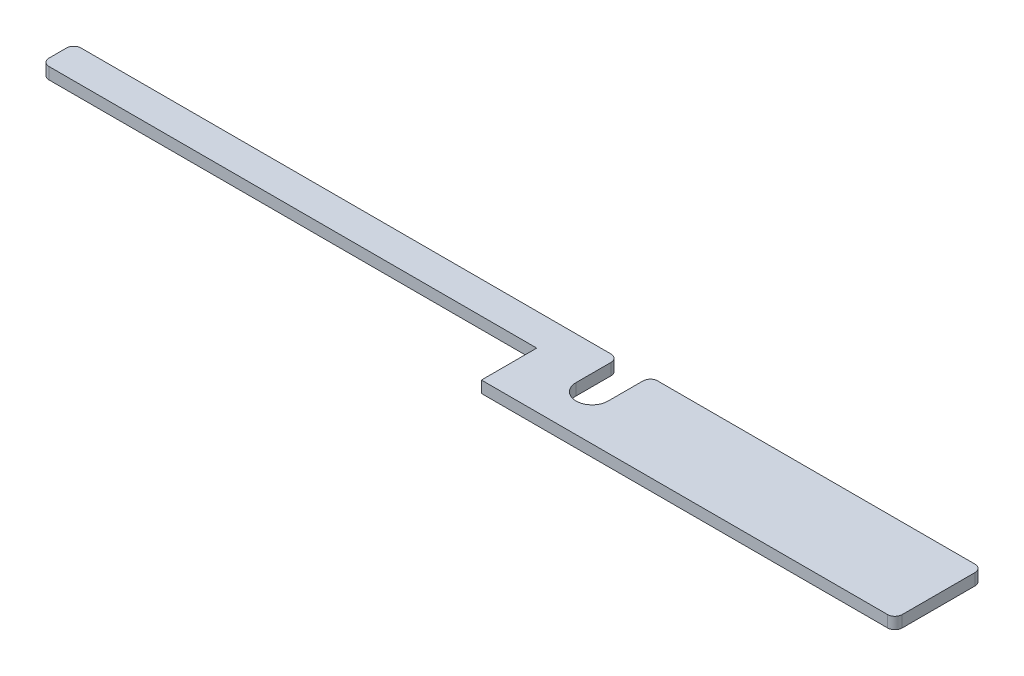
ISO-10303-21;
HEADER;
FILE_DESCRIPTION(('STEP AP214'),'2;1');
FILE_NAME('part.step','',(''),(''),'','','');
FILE_SCHEMA(('AUTOMOTIVE_DESIGN { 1 0 10303 214 1 1 1 1 }'));
ENDSEC;
DATA;
#1=APPLICATION_CONTEXT('core data for automotive mechanical design processes');
#2=APPLICATION_PROTOCOL_DEFINITION('international standard','automotive_design',2000,#1);
#3=PRODUCT_CONTEXT('',#1,'mechanical');
#4=PRODUCT('Part','Part','',(#3));
#5=PRODUCT_RELATED_PRODUCT_CATEGORY('part','',(#4));
#6=PRODUCT_DEFINITION_FORMATION('','',#4);
#7=PRODUCT_DEFINITION_CONTEXT('part definition',#1,'design');
#8=PRODUCT_DEFINITION('design','',#6,#7);
#9=PRODUCT_DEFINITION_SHAPE('','',#8);
#10=(LENGTH_UNIT() NAMED_UNIT(*) SI_UNIT(.MILLI.,.METRE.));
#11=(NAMED_UNIT(*) PLANE_ANGLE_UNIT() SI_UNIT($,.RADIAN.));
#12=(NAMED_UNIT(*) SI_UNIT($,.STERADIAN.) SOLID_ANGLE_UNIT());
#13=UNCERTAINTY_MEASURE_WITH_UNIT(LENGTH_MEASURE(1.E-05),#10,'distance_accuracy_value','');
#14=(GEOMETRIC_REPRESENTATION_CONTEXT(3) GLOBAL_UNCERTAINTY_ASSIGNED_CONTEXT((#13)) GLOBAL_UNIT_ASSIGNED_CONTEXT((#10,
#11,#12)) REPRESENTATION_CONTEXT('',''));
#15=CARTESIAN_POINT('',(0.,0.,0.));
#16=DIRECTION('',(0.,0.,1.));
#17=DIRECTION('',(1.,0.,0.));
#18=AXIS2_PLACEMENT_3D('',#15,#16,#17);
#19=CARTESIAN_POINT('',(0.,1.016,-7.62));
#20=DIRECTION('',(-1.,0.,0.));
#21=DIRECTION('',(0.,0.,1.));
#22=AXIS2_PLACEMENT_3D('',#19,#20,#21);
#23=PLANE('',#22);
#24=DIRECTION('',(0.,0.,-1.));
#25=VECTOR('',#24,1.);
#26=CARTESIAN_POINT('',(0.,0.,-7.62));
#27=LINE('',#26,#25);
#28=CARTESIAN_POINT('',(0.,0.,-0.635000000000002));
#29=VERTEX_POINT('',#28);
#30=CARTESIAN_POINT('',(0.,0.,-6.985));
#31=VERTEX_POINT('',#30);
#32=EDGE_CURVE('E193',#29,#31,#27,.T.);
#33=ORIENTED_EDGE('',*,*,#32,.T.);
#34=DIRECTION('',(0.,-1.,0.));
#35=VECTOR('',#34,1.);
#36=CARTESIAN_POINT('',(0.,1.016,-6.985));
#37=LINE('',#36,#35);
#38=CARTESIAN_POINT('',(0.,1.016,-6.985));
#39=VERTEX_POINT('',#38);
#40=EDGE_CURVE('E44',#31,#39,#37,.F.);
#41=ORIENTED_EDGE('',*,*,#40,.T.);
#42=DIRECTION('',(0.,0.,-1.));
#43=VECTOR('',#42,1.);
#44=CARTESIAN_POINT('',(0.,1.016,-7.62));
#45=LINE('',#44,#43);
#46=CARTESIAN_POINT('',(0.,1.016,-0.635000000000002));
#47=VERTEX_POINT('',#46);
#48=EDGE_CURVE('E217',#47,#39,#45,.T.);
#49=ORIENTED_EDGE('',*,*,#48,.F.);
#50=DIRECTION('',(0.,-1.,0.));
#51=VECTOR('',#50,1.);
#52=CARTESIAN_POINT('',(0.,1.016,-0.635));
#53=LINE('',#52,#51);
#54=EDGE_CURVE('E267',#47,#29,#53,.T.);
#55=ORIENTED_EDGE('',*,*,#54,.T.);
#56=EDGE_LOOP('',(#33,#41,#49,#55));
#57=FACE_BOUND('',#56,.T.);
#58=ADVANCED_FACE('F36',(#57),#23,.F.);
#59=CARTESIAN_POINT('',(-28.956,1.016,-7.62));
#60=DIRECTION('',(0.,0.,1.));
#61=DIRECTION('',(1.,0.,0.));
#62=AXIS2_PLACEMENT_3D('',#59,#60,#61);
#63=PLANE('',#62);
#64=DIRECTION('',(-1.,0.,0.));
#65=VECTOR('',#64,1.);
#66=CARTESIAN_POINT('',(-28.956,0.,-7.62));
#67=LINE('',#66,#65);
#68=CARTESIAN_POINT('',(-0.635000000000007,0.,-7.62));
#69=VERTEX_POINT('',#68);
#70=CARTESIAN_POINT('',(-28.321,0.,-7.62));
#71=VERTEX_POINT('',#70);
#72=EDGE_CURVE('E196',#69,#71,#67,.T.);
#73=ORIENTED_EDGE('',*,*,#72,.T.);
#74=DIRECTION('',(0.,-1.,0.));
#75=VECTOR('',#74,1.);
#76=CARTESIAN_POINT('',(-28.321,1.016,-7.62));
#77=LINE('',#76,#75);
#78=CARTESIAN_POINT('',(-28.321,1.016,-7.62));
#79=VERTEX_POINT('',#78);
#80=EDGE_CURVE('E263',#71,#79,#77,.F.);
#81=ORIENTED_EDGE('',*,*,#80,.T.);
#82=DIRECTION('',(-1.,0.,0.));
#83=VECTOR('',#82,1.);
#84=CARTESIAN_POINT('',(-28.956,1.016,-7.62));
#85=LINE('',#84,#83);
#86=CARTESIAN_POINT('',(-0.635000000000007,1.016,-7.62));
#87=VERTEX_POINT('',#86);
#88=EDGE_CURVE('E162',#87,#79,#85,.T.);
#89=ORIENTED_EDGE('',*,*,#88,.F.);
#90=DIRECTION('',(0.,-1.,0.));
#91=VECTOR('',#90,1.);
#92=CARTESIAN_POINT('',(-0.635,1.016,-7.62));
#93=LINE('',#92,#91);
#94=EDGE_CURVE('E260',#87,#69,#93,.T.);
#95=ORIENTED_EDGE('',*,*,#94,.T.);
#96=EDGE_LOOP('',(#73,#81,#89,#95));
#97=FACE_BOUND('',#96,.T.);
#98=ADVANCED_FACE('F284',(#97),#63,.F.);
#99=CARTESIAN_POINT('',(-28.956,1.016,-3.937));
#100=DIRECTION('',(1.,0.,0.));
#101=DIRECTION('',(0.,0.,-1.));
#102=AXIS2_PLACEMENT_3D('',#99,#100,#101);
#103=PLANE('',#102);
#104=DIRECTION('',(0.,0.,1.));
#105=VECTOR('',#104,1.);
#106=CARTESIAN_POINT('',(-28.956,1.016,-3.937));
#107=LINE('',#106,#105);
#108=CARTESIAN_POINT('',(-28.956,1.016,-6.985));
#109=VERTEX_POINT('',#108);
#110=CARTESIAN_POINT('',(-28.956,1.016,-3.937));
#111=VERTEX_POINT('',#110);
#112=EDGE_CURVE('E148',#109,#111,#107,.T.);
#113=ORIENTED_EDGE('',*,*,#112,.F.);
#114=DIRECTION('',(0.,-1.,0.));
#115=VECTOR('',#114,1.);
#116=CARTESIAN_POINT('',(-28.956,1.016,-6.985));
#117=LINE('',#116,#115);
#118=CARTESIAN_POINT('',(-28.956,0.,-6.985));
#119=VERTEX_POINT('',#118);
#120=EDGE_CURVE('E258',#109,#119,#117,.T.);
#121=ORIENTED_EDGE('',*,*,#120,.T.);
#122=DIRECTION('',(0.,0.,1.));
#123=VECTOR('',#122,1.);
#124=CARTESIAN_POINT('',(-28.956,0.,-3.937));
#125=LINE('',#124,#123);
#126=CARTESIAN_POINT('',(-28.956,0.,-3.937));
#127=VERTEX_POINT('',#126);
#128=EDGE_CURVE('E168',#119,#127,#125,.T.);
#129=ORIENTED_EDGE('',*,*,#128,.T.);
#130=DIRECTION('',(0.,-1.,0.));
#131=VECTOR('',#130,1.);
#132=CARTESIAN_POINT('',(-28.956,1.016,-3.937));
#133=LINE('',#132,#131);
#134=EDGE_CURVE('E165',#111,#127,#133,.T.);
#135=ORIENTED_EDGE('',*,*,#134,.F.);
#136=EDGE_LOOP('',(#113,#121,#129,#135));
#137=FACE_BOUND('',#136,.T.);
#138=ADVANCED_FACE('F166',(#137),#103,.F.);
#139=CARTESIAN_POINT('',(-30.353,1.016,-3.937));
#140=DIRECTION('',(0.,-1.,0.));
#141=DIRECTION('',(0.,0.,-1.));
#142=AXIS2_PLACEMENT_3D('',#139,#140,#141);
#143=CYLINDRICAL_SURFACE('',#142,1.397);
#144=CARTESIAN_POINT('',(-30.353,0.,-3.937));
#145=DIRECTION('',(0.,-1.,0.));
#146=DIRECTION('',(0.,0.,1.));
#147=AXIS2_PLACEMENT_3D('',#144,#145,#146);
#148=CIRCLE('',#147,1.397);
#149=CARTESIAN_POINT('',(-31.75,0.,-3.937));
#150=VERTEX_POINT('',#149);
#151=EDGE_CURVE('E200',#127,#150,#148,.T.);
#152=ORIENTED_EDGE('',*,*,#151,.T.);
#153=DIRECTION('',(0.,-1.,0.));
#154=VECTOR('',#153,1.);
#155=CARTESIAN_POINT('',(-31.75,1.016,-3.937));
#156=LINE('',#155,#154);
#157=CARTESIAN_POINT('',(-31.75,1.016,-3.937));
#158=VERTEX_POINT('',#157);
#159=EDGE_CURVE('E172',#158,#150,#156,.T.);
#160=ORIENTED_EDGE('',*,*,#159,.F.);
#161=CARTESIAN_POINT('',(-30.353,1.016,-3.937));
#162=DIRECTION('',(0.,-1.,0.));
#163=DIRECTION('',(0.,0.,1.));
#164=AXIS2_PLACEMENT_3D('',#161,#162,#163);
#165=CIRCLE('',#164,1.397);
#166=EDGE_CURVE('E154',#111,#158,#165,.T.);
#167=ORIENTED_EDGE('',*,*,#166,.F.);
#168=ORIENTED_EDGE('',*,*,#134,.T.);
#169=EDGE_LOOP('',(#152,#160,#167,#168));
#170=FACE_BOUND('',#169,.T.);
#171=ADVANCED_FACE('F174',(#170),#143,.F.);
#172=CARTESIAN_POINT('',(-31.75,1.016,-7.62));
#173=DIRECTION('',(-1.,0.,0.));
#174=DIRECTION('',(0.,0.,1.));
#175=AXIS2_PLACEMENT_3D('',#172,#173,#174);
#176=PLANE('',#175);
#177=DIRECTION('',(0.,0.,-1.));
#178=VECTOR('',#177,1.);
#179=CARTESIAN_POINT('',(-31.75,0.,-7.62));
#180=LINE('',#179,#178);
#181=CARTESIAN_POINT('',(-31.75,0.,-6.985));
#182=VERTEX_POINT('',#181);
#183=EDGE_CURVE('E202',#150,#182,#180,.T.);
#184=ORIENTED_EDGE('',*,*,#183,.T.);
#185=DIRECTION('',(0.,-1.,0.));
#186=VECTOR('',#185,1.);
#187=CARTESIAN_POINT('',(-31.75,1.016,-6.985));
#188=LINE('',#187,#186);
#189=CARTESIAN_POINT('',(-31.75,1.016,-6.985));
#190=VERTEX_POINT('',#189);
#191=EDGE_CURVE('E265',#182,#190,#188,.F.);
#192=ORIENTED_EDGE('',*,*,#191,.T.);
#193=DIRECTION('',(0.,0.,-1.));
#194=VECTOR('',#193,1.);
#195=CARTESIAN_POINT('',(-31.75,1.016,-7.62));
#196=LINE('',#195,#194);
#197=EDGE_CURVE('E177',#158,#190,#196,.T.);
#198=ORIENTED_EDGE('',*,*,#197,.F.);
#199=ORIENTED_EDGE('',*,*,#159,.T.);
#200=EDGE_LOOP('',(#184,#192,#198,#199));
#201=FACE_BOUND('',#200,.T.);
#202=ADVANCED_FACE('F413',(#201),#176,.F.);
#203=CARTESIAN_POINT('',(-79.248,1.016,-7.62));
#204=DIRECTION('',(0.,0.,1.));
#205=DIRECTION('',(1.,0.,0.));
#206=AXIS2_PLACEMENT_3D('',#203,#204,#205);
#207=PLANE('',#206);
#208=DIRECTION('',(-1.,0.,0.));
#209=VECTOR('',#208,1.);
#210=CARTESIAN_POINT('',(-79.248,0.,-7.62));
#211=LINE('',#210,#209);
#212=CARTESIAN_POINT('',(-32.385,0.,-7.62));
#213=VERTEX_POINT('',#212);
#214=CARTESIAN_POINT('',(-78.613,0.,-7.62));
#215=VERTEX_POINT('',#214);
#216=EDGE_CURVE('E205',#213,#215,#211,.T.);
#217=ORIENTED_EDGE('',*,*,#216,.T.);
#218=DIRECTION('',(0.,-1.,0.));
#219=VECTOR('',#218,1.);
#220=CARTESIAN_POINT('',(-78.613,1.016,-7.62));
#221=LINE('',#220,#219);
#222=CARTESIAN_POINT('',(-78.613,1.016,-7.62));
#223=VERTEX_POINT('',#222);
#224=EDGE_CURVE('E243',#215,#223,#221,.F.);
#225=ORIENTED_EDGE('',*,*,#224,.T.);
#226=DIRECTION('',(-1.,0.,0.));
#227=VECTOR('',#226,1.);
#228=CARTESIAN_POINT('',(-79.248,1.016,-7.62));
#229=LINE('',#228,#227);
#230=CARTESIAN_POINT('',(-32.385,1.016,-7.62));
#231=VERTEX_POINT('',#230);
#232=EDGE_CURVE('E179',#231,#223,#229,.T.);
#233=ORIENTED_EDGE('',*,*,#232,.F.);
#234=DIRECTION('',(0.,-1.,0.));
#235=VECTOR('',#234,1.);
#236=CARTESIAN_POINT('',(-32.385,1.016,-7.62));
#237=LINE('',#236,#235);
#238=EDGE_CURVE('E240',#231,#213,#237,.T.);
#239=ORIENTED_EDGE('',*,*,#238,.T.);
#240=EDGE_LOOP('',(#217,#225,#233,#239));
#241=FACE_BOUND('',#240,.T.);
#242=ADVANCED_FACE('F404',(#241),#207,.F.);
#243=CARTESIAN_POINT('',(-79.248,1.016,-4.826));
#244=DIRECTION('',(1.,0.,0.));
#245=DIRECTION('',(0.,0.,-1.));
#246=AXIS2_PLACEMENT_3D('',#243,#244,#245);
#247=PLANE('',#246);
#248=DIRECTION('',(0.,0.,1.));
#249=VECTOR('',#248,1.);
#250=CARTESIAN_POINT('',(-79.248,1.016,-4.826));
#251=LINE('',#250,#249);
#252=CARTESIAN_POINT('',(-79.248,1.016,-6.985));
#253=VERTEX_POINT('',#252);
#254=CARTESIAN_POINT('',(-79.248,1.016,-5.461));
#255=VERTEX_POINT('',#254);
#256=EDGE_CURVE('E184',#253,#255,#251,.T.);
#257=ORIENTED_EDGE('',*,*,#256,.F.);
#258=DIRECTION('',(0.,-1.,0.));
#259=VECTOR('',#258,1.);
#260=CARTESIAN_POINT('',(-79.248,1.016,-6.985));
#261=LINE('',#260,#259);
#262=CARTESIAN_POINT('',(-79.248,0.,-6.985));
#263=VERTEX_POINT('',#262);
#264=EDGE_CURVE('E225',#253,#263,#261,.T.);
#265=ORIENTED_EDGE('',*,*,#264,.T.);
#266=DIRECTION('',(0.,0.,1.));
#267=VECTOR('',#266,1.);
#268=CARTESIAN_POINT('',(-79.248,0.,-4.826));
#269=LINE('',#268,#267);
#270=CARTESIAN_POINT('',(-79.248,0.,-5.461));
#271=VERTEX_POINT('',#270);
#272=EDGE_CURVE('E208',#263,#271,#269,.T.);
#273=ORIENTED_EDGE('',*,*,#272,.T.);
#274=DIRECTION('',(0.,-1.,0.));
#275=VECTOR('',#274,1.);
#276=CARTESIAN_POINT('',(-79.248,1.016,-5.461));
#277=LINE('',#276,#275);
#278=EDGE_CURVE('E171',#271,#255,#277,.F.);
#279=ORIENTED_EDGE('',*,*,#278,.T.);
#280=EDGE_LOOP('',(#257,#265,#273,#279));
#281=FACE_BOUND('',#280,.T.);
#282=ADVANCED_FACE('F324',(#281),#247,.F.);
#283=CARTESIAN_POINT('',(-36.068,1.016,-4.82600000000001));
#284=DIRECTION('',(0.,0.,-1.));
#285=DIRECTION('',(-1.,0.,0.));
#286=AXIS2_PLACEMENT_3D('',#283,#284,#285);
#287=PLANE('',#286);
#288=DIRECTION('',(1.,0.,0.));
#289=VECTOR('',#288,1.);
#290=CARTESIAN_POINT('',(-36.068,1.016,-4.82600000000001));
#291=LINE('',#290,#289);
#292=CARTESIAN_POINT('',(-78.613,1.016,-4.826));
#293=VERTEX_POINT('',#292);
#294=CARTESIAN_POINT('',(-36.068,1.016,-4.82600000000001));
#295=VERTEX_POINT('',#294);
#296=EDGE_CURVE('E186',#293,#295,#291,.T.);
#297=ORIENTED_EDGE('',*,*,#296,.F.);
#298=DIRECTION('',(0.,-1.,0.));
#299=VECTOR('',#298,1.);
#300=CARTESIAN_POINT('',(-78.613,1.016,-4.826));
#301=LINE('',#300,#299);
#302=CARTESIAN_POINT('',(-78.613,0.,-4.826));
#303=VERTEX_POINT('',#302);
#304=EDGE_CURVE('E255',#293,#303,#301,.T.);
#305=ORIENTED_EDGE('',*,*,#304,.T.);
#306=DIRECTION('',(1.,0.,0.));
#307=VECTOR('',#306,1.);
#308=CARTESIAN_POINT('',(-36.068,0.,-4.82600000000001));
#309=LINE('',#308,#307);
#310=CARTESIAN_POINT('',(-36.068,0.,-4.82600000000001));
#311=VERTEX_POINT('',#310);
#312=EDGE_CURVE('E211',#303,#311,#309,.T.);
#313=ORIENTED_EDGE('',*,*,#312,.T.);
#314=DIRECTION('',(0.,-1.,0.));
#315=VECTOR('',#314,1.);
#316=CARTESIAN_POINT('',(-36.068,1.016,-4.82600000000001));
#317=LINE('',#316,#315);
#318=EDGE_CURVE('E220',#295,#311,#317,.T.);
#319=ORIENTED_EDGE('',*,*,#318,.F.);
#320=EDGE_LOOP('',(#297,#305,#313,#319));
#321=FACE_BOUND('',#320,.T.);
#322=ADVANCED_FACE('F329',(#321),#287,.F.);
#323=CARTESIAN_POINT('',(-36.068,1.016,0.));
#324=DIRECTION('',(1.,0.,0.));
#325=DIRECTION('',(0.,0.,-1.));
#326=AXIS2_PLACEMENT_3D('',#323,#324,#325);
#327=PLANE('',#326);
#328=DIRECTION('',(0.,0.,1.));
#329=VECTOR('',#328,1.);
#330=CARTESIAN_POINT('',(-36.068,0.,0.));
#331=LINE('',#330,#329);
#332=CARTESIAN_POINT('',(-36.068,0.,0.));
#333=VERTEX_POINT('',#332);
#334=EDGE_CURVE('E213',#311,#333,#331,.T.);
#335=ORIENTED_EDGE('',*,*,#334,.T.);
#336=DIRECTION('',(0.,-1.,0.));
#337=VECTOR('',#336,1.);
#338=CARTESIAN_POINT('',(-36.068,1.016,0.));
#339=LINE('',#338,#337);
#340=CARTESIAN_POINT('',(-36.068,1.016,0.));
#341=VERTEX_POINT('',#340);
#342=EDGE_CURVE('E192',#341,#333,#339,.T.);
#343=ORIENTED_EDGE('',*,*,#342,.F.);
#344=DIRECTION('',(0.,0.,1.));
#345=VECTOR('',#344,1.);
#346=CARTESIAN_POINT('',(-36.068,1.016,0.));
#347=LINE('',#346,#345);
#348=EDGE_CURVE('E188',#295,#341,#347,.T.);
#349=ORIENTED_EDGE('',*,*,#348,.F.);
#350=ORIENTED_EDGE('',*,*,#318,.T.);
#351=EDGE_LOOP('',(#335,#343,#349,#350));
#352=FACE_BOUND('',#351,.T.);
#353=ADVANCED_FACE('F335',(#352),#327,.F.);
#354=CARTESIAN_POINT('',(0.,1.016,0.));
#355=DIRECTION('',(0.,0.,-1.));
#356=DIRECTION('',(-1.,0.,0.));
#357=AXIS2_PLACEMENT_3D('',#354,#355,#356);
#358=PLANE('',#357);
#359=DIRECTION('',(1.,0.,0.));
#360=VECTOR('',#359,1.);
#361=CARTESIAN_POINT('',(0.,0.,0.));
#362=LINE('',#361,#360);
#363=CARTESIAN_POINT('',(-0.635,0.,0.));
#364=VERTEX_POINT('',#363);
#365=EDGE_CURVE('E215',#333,#364,#362,.T.);
#366=ORIENTED_EDGE('',*,*,#365,.T.);
#367=DIRECTION('',(0.,-1.,0.));
#368=VECTOR('',#367,1.);
#369=CARTESIAN_POINT('',(-0.635,1.016,0.));
#370=LINE('',#369,#368);
#371=CARTESIAN_POINT('',(-0.635,1.016,0.));
#372=VERTEX_POINT('',#371);
#373=EDGE_CURVE('E11',#364,#372,#370,.F.);
#374=ORIENTED_EDGE('',*,*,#373,.T.);
#375=DIRECTION('',(1.,0.,0.));
#376=VECTOR('',#375,1.);
#377=CARTESIAN_POINT('',(0.,1.016,0.));
#378=LINE('',#377,#376);
#379=EDGE_CURVE('E190',#341,#372,#378,.T.);
#380=ORIENTED_EDGE('',*,*,#379,.F.);
#381=ORIENTED_EDGE('',*,*,#342,.T.);
#382=EDGE_LOOP('',(#366,#374,#380,#381));
#383=FACE_BOUND('',#382,.T.);
#384=ADVANCED_FACE('F337',(#383),#358,.F.);
#385=CARTESIAN_POINT('',(-30.353,1.016,-3.937));
#386=DIRECTION('',(0.,1.,0.));
#387=DIRECTION('',(0.,0.,1.));
#388=AXIS2_PLACEMENT_3D('',#385,#386,#387);
#389=PLANE('',#388);
#390=ORIENTED_EDGE('',*,*,#232,.T.);
#391=CARTESIAN_POINT('',(-78.613,1.016,-6.985));
#392=DIRECTION('',(0.,1.,0.));
#393=DIRECTION('',(0.,0.,1.));
#394=AXIS2_PLACEMENT_3D('',#391,#392,#393);
#395=CIRCLE('',#394,0.635);
#396=EDGE_CURVE('E253',#223,#253,#395,.T.);
#397=ORIENTED_EDGE('',*,*,#396,.T.);
#398=ORIENTED_EDGE('',*,*,#256,.T.);
#399=CARTESIAN_POINT('',(-78.613,1.016,-5.461));
#400=DIRECTION('',(0.,1.,0.));
#401=DIRECTION('',(0.,0.,1.));
#402=AXIS2_PLACEMENT_3D('',#399,#400,#401);
#403=CIRCLE('',#402,0.635);
#404=EDGE_CURVE('E57',#255,#293,#403,.T.);
#405=ORIENTED_EDGE('',*,*,#404,.T.);
#406=ORIENTED_EDGE('',*,*,#296,.T.);
#407=ORIENTED_EDGE('',*,*,#348,.T.);
#408=ORIENTED_EDGE('',*,*,#379,.T.);
#409=CARTESIAN_POINT('',(-0.635,1.016,-0.635));
#410=DIRECTION('',(0.,1.,0.));
#411=DIRECTION('',(0.,0.,1.));
#412=AXIS2_PLACEMENT_3D('',#409,#410,#411);
#413=CIRCLE('',#412,0.635);
#414=EDGE_CURVE('E245',#372,#47,#413,.T.);
#415=ORIENTED_EDGE('',*,*,#414,.T.);
#416=ORIENTED_EDGE('',*,*,#48,.T.);
#417=CARTESIAN_POINT('',(-0.635,1.016,-6.985));
#418=DIRECTION('',(0.,1.,0.));
#419=DIRECTION('',(0.,0.,1.));
#420=AXIS2_PLACEMENT_3D('',#417,#418,#419);
#421=CIRCLE('',#420,0.635);
#422=EDGE_CURVE('E247',#39,#87,#421,.T.);
#423=ORIENTED_EDGE('',*,*,#422,.T.);
#424=ORIENTED_EDGE('',*,*,#88,.T.);
#425=CARTESIAN_POINT('',(-28.321,1.016,-6.985));
#426=DIRECTION('',(0.,1.,0.));
#427=DIRECTION('',(0.,0.,1.));
#428=AXIS2_PLACEMENT_3D('',#425,#426,#427);
#429=CIRCLE('',#428,0.635);
#430=EDGE_CURVE('E158',#79,#109,#429,.T.);
#431=ORIENTED_EDGE('',*,*,#430,.T.);
#432=ORIENTED_EDGE('',*,*,#112,.T.);
#433=ORIENTED_EDGE('',*,*,#166,.T.);
#434=ORIENTED_EDGE('',*,*,#197,.T.);
#435=CARTESIAN_POINT('',(-32.385,1.016,-6.985));
#436=DIRECTION('',(0.,1.,0.));
#437=DIRECTION('',(0.,0.,1.));
#438=AXIS2_PLACEMENT_3D('',#435,#436,#437);
#439=CIRCLE('',#438,0.635);
#440=EDGE_CURVE('E249',#190,#231,#439,.T.);
#441=ORIENTED_EDGE('',*,*,#440,.T.);
#442=EDGE_LOOP('',(#390,#397,#398,#405,#406,#407,#408,#415,#416,#423,#424,#431,#432,#433,#434,#441));
#443=FACE_BOUND('',#442,.T.);
#444=ADVANCED_FACE('F151',(#443),#389,.T.);
#445=CARTESIAN_POINT('',(-30.353,0.,-3.937));
#446=DIRECTION('',(0.,1.,0.));
#447=DIRECTION('',(0.,0.,1.));
#448=AXIS2_PLACEMENT_3D('',#445,#446,#447);
#449=PLANE('',#448);
#450=ORIENTED_EDGE('',*,*,#272,.F.);
#451=CARTESIAN_POINT('',(-78.613,0.,-6.985));
#452=DIRECTION('',(0.,1.,0.));
#453=DIRECTION('',(0.,0.,1.));
#454=AXIS2_PLACEMENT_3D('',#451,#452,#453);
#455=CIRCLE('',#454,0.635);
#456=EDGE_CURVE('E238',#263,#215,#455,.F.);
#457=ORIENTED_EDGE('',*,*,#456,.T.);
#458=ORIENTED_EDGE('',*,*,#216,.F.);
#459=CARTESIAN_POINT('',(-32.385,0.,-6.985));
#460=DIRECTION('',(0.,1.,0.));
#461=DIRECTION('',(0.,0.,1.));
#462=AXIS2_PLACEMENT_3D('',#459,#460,#461);
#463=CIRCLE('',#462,0.635);
#464=EDGE_CURVE('E232',#213,#182,#463,.F.);
#465=ORIENTED_EDGE('',*,*,#464,.T.);
#466=ORIENTED_EDGE('',*,*,#183,.F.);
#467=ORIENTED_EDGE('',*,*,#151,.F.);
#468=ORIENTED_EDGE('',*,*,#128,.F.);
#469=CARTESIAN_POINT('',(-28.321,0.,-6.985));
#470=DIRECTION('',(0.,1.,0.));
#471=DIRECTION('',(0.,0.,1.));
#472=AXIS2_PLACEMENT_3D('',#469,#470,#471);
#473=CIRCLE('',#472,0.635);
#474=EDGE_CURVE('E234',#119,#71,#473,.F.);
#475=ORIENTED_EDGE('',*,*,#474,.T.);
#476=ORIENTED_EDGE('',*,*,#72,.F.);
#477=CARTESIAN_POINT('',(-0.635,0.,-6.985));
#478=DIRECTION('',(0.,1.,0.));
#479=DIRECTION('',(0.,0.,1.));
#480=AXIS2_PLACEMENT_3D('',#477,#478,#479);
#481=CIRCLE('',#480,0.635);
#482=EDGE_CURVE('E230',#69,#31,#481,.F.);
#483=ORIENTED_EDGE('',*,*,#482,.T.);
#484=ORIENTED_EDGE('',*,*,#32,.F.);
#485=CARTESIAN_POINT('',(-0.635,0.,-0.635));
#486=DIRECTION('',(0.,1.,0.));
#487=DIRECTION('',(0.,0.,1.));
#488=AXIS2_PLACEMENT_3D('',#485,#486,#487);
#489=CIRCLE('',#488,0.635);
#490=EDGE_CURVE('E228',#29,#364,#489,.F.);
#491=ORIENTED_EDGE('',*,*,#490,.T.);
#492=ORIENTED_EDGE('',*,*,#365,.F.);
#493=ORIENTED_EDGE('',*,*,#334,.F.);
#494=ORIENTED_EDGE('',*,*,#312,.F.);
#495=CARTESIAN_POINT('',(-78.613,0.,-5.461));
#496=DIRECTION('',(0.,1.,0.));
#497=DIRECTION('',(0.,0.,1.));
#498=AXIS2_PLACEMENT_3D('',#495,#496,#497);
#499=CIRCLE('',#498,0.635);
#500=EDGE_CURVE('E236',#303,#271,#499,.F.);
#501=ORIENTED_EDGE('',*,*,#500,.T.);
#502=EDGE_LOOP('',(#450,#457,#458,#465,#466,#467,#468,#475,#476,#483,#484,#491,#492,#493,#494,#501));
#503=FACE_BOUND('',#502,.T.);
#504=ADVANCED_FACE('F288',(#503),#449,.F.);
#505=CARTESIAN_POINT('',(-78.613,1.016,-6.985));
#506=DIRECTION('',(0.,-1.,0.));
#507=DIRECTION('',(0.,0.,-1.));
#508=AXIS2_PLACEMENT_3D('',#505,#506,#507);
#509=CYLINDRICAL_SURFACE('',#508,0.635);
#510=ORIENTED_EDGE('',*,*,#396,.F.);
#511=ORIENTED_EDGE('',*,*,#224,.F.);
#512=ORIENTED_EDGE('',*,*,#456,.F.);
#513=ORIENTED_EDGE('',*,*,#264,.F.);
#514=EDGE_LOOP('',(#510,#511,#512,#513));
#515=FACE_BOUND('',#514,.T.);
#516=ADVANCED_FACE('F301',(#515),#509,.T.);
#517=CARTESIAN_POINT('',(-78.613,1.016,-5.461));
#518=DIRECTION('',(0.,-1.,0.));
#519=DIRECTION('',(0.,0.,-1.));
#520=AXIS2_PLACEMENT_3D('',#517,#518,#519);
#521=CYLINDRICAL_SURFACE('',#520,0.635);
#522=ORIENTED_EDGE('',*,*,#404,.F.);
#523=ORIENTED_EDGE('',*,*,#278,.F.);
#524=ORIENTED_EDGE('',*,*,#500,.F.);
#525=ORIENTED_EDGE('',*,*,#304,.F.);
#526=EDGE_LOOP('',(#522,#523,#524,#525));
#527=FACE_BOUND('',#526,.T.);
#528=ADVANCED_FACE('F293',(#527),#521,.T.);
#529=CARTESIAN_POINT('',(-28.321,1.016,-6.985));
#530=DIRECTION('',(0.,-1.,0.));
#531=DIRECTION('',(0.,0.,-1.));
#532=AXIS2_PLACEMENT_3D('',#529,#530,#531);
#533=CYLINDRICAL_SURFACE('',#532,0.635);
#534=ORIENTED_EDGE('',*,*,#430,.F.);
#535=ORIENTED_EDGE('',*,*,#80,.F.);
#536=ORIENTED_EDGE('',*,*,#474,.F.);
#537=ORIENTED_EDGE('',*,*,#120,.F.);
#538=EDGE_LOOP('',(#534,#535,#536,#537));
#539=FACE_BOUND('',#538,.T.);
#540=ADVANCED_FACE('F290',(#539),#533,.T.);
#541=CARTESIAN_POINT('',(-32.385,1.016,-6.985));
#542=DIRECTION('',(0.,-1.,0.));
#543=DIRECTION('',(0.,0.,-1.));
#544=AXIS2_PLACEMENT_3D('',#541,#542,#543);
#545=CYLINDRICAL_SURFACE('',#544,0.635);
#546=ORIENTED_EDGE('',*,*,#440,.F.);
#547=ORIENTED_EDGE('',*,*,#191,.F.);
#548=ORIENTED_EDGE('',*,*,#464,.F.);
#549=ORIENTED_EDGE('',*,*,#238,.F.);
#550=EDGE_LOOP('',(#546,#547,#548,#549));
#551=FACE_BOUND('',#550,.T.);
#552=ADVANCED_FACE('F292',(#551),#545,.T.);
#553=CARTESIAN_POINT('',(-0.635,1.016,-6.985));
#554=DIRECTION('',(0.,-1.,0.));
#555=DIRECTION('',(0.,0.,-1.));
#556=AXIS2_PLACEMENT_3D('',#553,#554,#555);
#557=CYLINDRICAL_SURFACE('',#556,0.635);
#558=ORIENTED_EDGE('',*,*,#422,.F.);
#559=ORIENTED_EDGE('',*,*,#40,.F.);
#560=ORIENTED_EDGE('',*,*,#482,.F.);
#561=ORIENTED_EDGE('',*,*,#94,.F.);
#562=EDGE_LOOP('',(#558,#559,#560,#561));
#563=FACE_BOUND('',#562,.T.);
#564=ADVANCED_FACE('F281',(#563),#557,.T.);
#565=CARTESIAN_POINT('',(-0.635,1.016,-0.635));
#566=DIRECTION('',(0.,-1.,0.));
#567=DIRECTION('',(0.,0.,-1.));
#568=AXIS2_PLACEMENT_3D('',#565,#566,#567);
#569=CYLINDRICAL_SURFACE('',#568,0.635);
#570=ORIENTED_EDGE('',*,*,#414,.F.);
#571=ORIENTED_EDGE('',*,*,#373,.F.);
#572=ORIENTED_EDGE('',*,*,#490,.F.);
#573=ORIENTED_EDGE('',*,*,#54,.F.);
#574=EDGE_LOOP('',(#570,#571,#572,#573));
#575=FACE_BOUND('',#574,.T.);
#576=ADVANCED_FACE('F38',(#575),#569,.T.);
#577=CLOSED_SHELL('',(#58,#98,#138,#171,#202,#242,#282,#322,#353,#384,#444,#504,#516,#528,#540,
#552,#564,#576));
#578=MANIFOLD_SOLID_BREP('B2',#577);
#579=ADVANCED_BREP_SHAPE_REPRESENTATION('',(#18,#578),#14);
#580=SHAPE_DEFINITION_REPRESENTATION(#9,#579);
ENDSEC;
END-ISO-10303-21;
